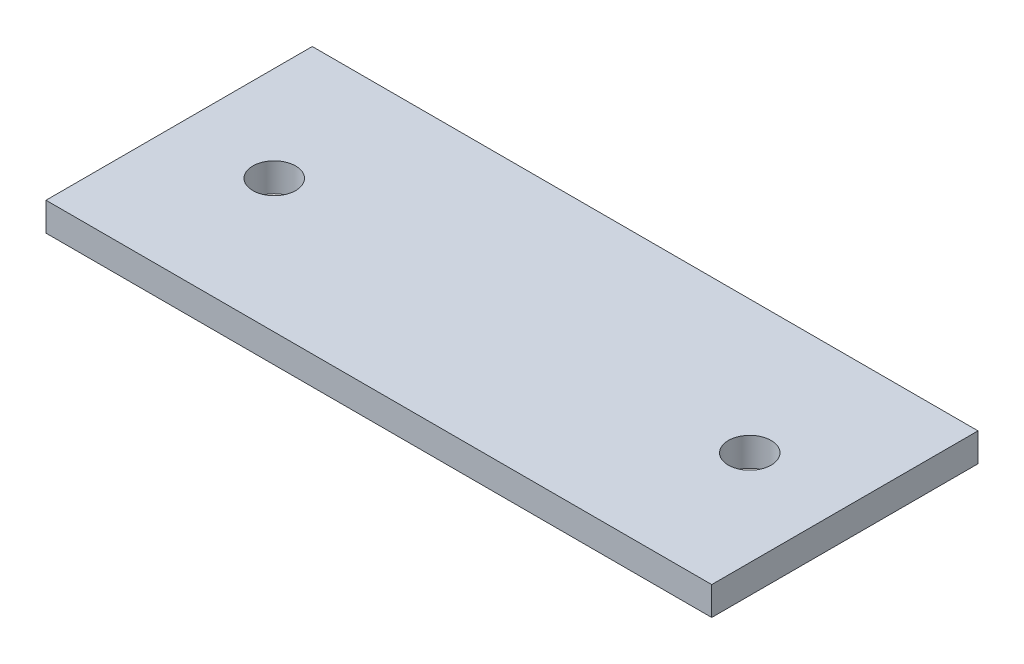
ISO-10303-21;
HEADER;
FILE_DESCRIPTION(('STEP AP214'),'2;1');
FILE_NAME('part.step','',(''),(''),'','','');
FILE_SCHEMA(('AUTOMOTIVE_DESIGN { 1 0 10303 214 1 1 1 1 }'));
ENDSEC;
DATA;
#1=APPLICATION_CONTEXT('core data for automotive mechanical design processes');
#2=APPLICATION_PROTOCOL_DEFINITION('international standard','automotive_design',2000,#1);
#3=PRODUCT_CONTEXT('',#1,'mechanical');
#4=PRODUCT('Part','Part','',(#3));
#5=PRODUCT_RELATED_PRODUCT_CATEGORY('part','',(#4));
#6=PRODUCT_DEFINITION_FORMATION('','',#4);
#7=PRODUCT_DEFINITION_CONTEXT('part definition',#1,'design');
#8=PRODUCT_DEFINITION('design','',#6,#7);
#9=PRODUCT_DEFINITION_SHAPE('','',#8);
#10=(LENGTH_UNIT() NAMED_UNIT(*) SI_UNIT(.MILLI.,.METRE.));
#11=(NAMED_UNIT(*) PLANE_ANGLE_UNIT() SI_UNIT($,.RADIAN.));
#12=(NAMED_UNIT(*) SI_UNIT($,.STERADIAN.) SOLID_ANGLE_UNIT());
#13=UNCERTAINTY_MEASURE_WITH_UNIT(LENGTH_MEASURE(1.E-05),#10,'distance_accuracy_value','');
#14=(GEOMETRIC_REPRESENTATION_CONTEXT(3) GLOBAL_UNCERTAINTY_ASSIGNED_CONTEXT((#13)) GLOBAL_UNIT_ASSIGNED_CONTEXT((#10,
#11,#12)) REPRESENTATION_CONTEXT('',''));
#15=CARTESIAN_POINT('',(0.,0.,0.));
#16=DIRECTION('',(0.,0.,1.));
#17=DIRECTION('',(1.,0.,0.));
#18=AXIS2_PLACEMENT_3D('',#15,#16,#17);
#19=CARTESIAN_POINT('',(0.,3.,0.));
#20=DIRECTION('',(0.,-1.,0.));
#21=DIRECTION('',(0.,0.,-1.));
#22=AXIS2_PLACEMENT_3D('',#19,#20,#21);
#23=PLANE('',#22);
#24=DIRECTION('',(0.,0.,1.));
#25=VECTOR('',#24,1.);
#26=CARTESIAN_POINT('',(0.,3.,0.));
#27=LINE('',#26,#25);
#28=CARTESIAN_POINT('',(0.,3.,-28.));
#29=VERTEX_POINT('',#28);
#30=CARTESIAN_POINT('',(0.,3.,0.));
#31=VERTEX_POINT('',#30);
#32=EDGE_CURVE('E85',#29,#31,#27,.T.);
#33=ORIENTED_EDGE('',*,*,#32,.T.);
#34=DIRECTION('',(1.,0.,0.));
#35=VECTOR('',#34,1.);
#36=CARTESIAN_POINT('',(0.,3.,0.));
#37=LINE('',#36,#35);
#38=CARTESIAN_POINT('',(70.,3.,0.));
#39=VERTEX_POINT('',#38);
#40=EDGE_CURVE('E80',#31,#39,#37,.T.);
#41=ORIENTED_EDGE('',*,*,#40,.T.);
#42=DIRECTION('',(0.,0.,-1.));
#43=VECTOR('',#42,1.);
#44=CARTESIAN_POINT('',(70.,3.,0.));
#45=LINE('',#44,#43);
#46=CARTESIAN_POINT('',(70.,3.,-28.));
#47=VERTEX_POINT('',#46);
#48=EDGE_CURVE('E83',#39,#47,#45,.T.);
#49=ORIENTED_EDGE('',*,*,#48,.T.);
#50=DIRECTION('',(-1.,0.,0.));
#51=VECTOR('',#50,1.);
#52=CARTESIAN_POINT('',(0.,3.,-28.));
#53=LINE('',#52,#51);
#54=EDGE_CURVE('E50',#47,#29,#53,.T.);
#55=ORIENTED_EDGE('',*,*,#54,.T.);
#56=EDGE_LOOP('',(#33,#41,#49,#55));
#57=FACE_BOUND('',#56,.T.);
#58=CARTESIAN_POINT('',(10.,3.,-14.));
#59=DIRECTION('',(0.,1.,0.));
#60=DIRECTION('',(0.,0.,1.));
#61=AXIS2_PLACEMENT_3D('',#58,#59,#60);
#62=CIRCLE('',#61,2.25);
#63=CARTESIAN_POINT('',(10.,3.,-11.75));
#64=VERTEX_POINT('',#63);
#65=EDGE_CURVE('E100',#64,#64,#62,.T.);
#66=ORIENTED_EDGE('',*,*,#65,.F.);
#67=EDGE_LOOP('',(#66));
#68=FACE_BOUND('',#67,.T.);
#69=CARTESIAN_POINT('',(60.,3.,-14.));
#70=DIRECTION('',(0.,1.,0.));
#71=DIRECTION('',(0.,0.,1.));
#72=AXIS2_PLACEMENT_3D('',#69,#70,#71);
#73=CIRCLE('',#72,2.25);
#74=CARTESIAN_POINT('',(60.,3.,-11.75));
#75=VERTEX_POINT('',#74);
#76=EDGE_CURVE('E115',#75,#75,#73,.T.);
#77=ORIENTED_EDGE('',*,*,#76,.F.);
#78=EDGE_LOOP('',(#77));
#79=FACE_BOUND('',#78,.T.);
#80=ADVANCED_FACE('F33',(#57,#68,#79),#23,.F.);
#81=CARTESIAN_POINT('',(0.,0.,0.));
#82=DIRECTION('',(0.,-1.,0.));
#83=DIRECTION('',(0.,0.,-1.));
#84=AXIS2_PLACEMENT_3D('',#81,#82,#83);
#85=PLANE('',#84);
#86=CARTESIAN_POINT('',(10.,0.,-14.));
#87=DIRECTION('',(0.,1.,0.));
#88=DIRECTION('',(0.,0.,1.));
#89=AXIS2_PLACEMENT_3D('',#86,#87,#88);
#90=CIRCLE('',#89,2.25);
#91=CARTESIAN_POINT('',(10.,0.,-11.75));
#92=VERTEX_POINT('',#91);
#93=EDGE_CURVE('E112',#92,#92,#90,.T.);
#94=ORIENTED_EDGE('',*,*,#93,.T.);
#95=EDGE_LOOP('',(#94));
#96=FACE_BOUND('',#95,.T.);
#97=DIRECTION('',(0.,0.,1.));
#98=VECTOR('',#97,1.);
#99=CARTESIAN_POINT('',(0.,0.,0.));
#100=LINE('',#99,#98);
#101=CARTESIAN_POINT('',(0.,0.,-28.));
#102=VERTEX_POINT('',#101);
#103=CARTESIAN_POINT('',(0.,0.,0.));
#104=VERTEX_POINT('',#103);
#105=EDGE_CURVE('E97',#102,#104,#100,.T.);
#106=ORIENTED_EDGE('',*,*,#105,.F.);
#107=DIRECTION('',(-1.,0.,0.));
#108=VECTOR('',#107,1.);
#109=CARTESIAN_POINT('',(0.,0.,-28.));
#110=LINE('',#109,#108);
#111=CARTESIAN_POINT('',(70.,0.,-28.));
#112=VERTEX_POINT('',#111);
#113=EDGE_CURVE('E73',#112,#102,#110,.T.);
#114=ORIENTED_EDGE('',*,*,#113,.F.);
#115=DIRECTION('',(0.,0.,-1.));
#116=VECTOR('',#115,1.);
#117=CARTESIAN_POINT('',(70.,0.,0.));
#118=LINE('',#117,#116);
#119=CARTESIAN_POINT('',(70.,0.,0.));
#120=VERTEX_POINT('',#119);
#121=EDGE_CURVE('E67',#120,#112,#118,.T.);
#122=ORIENTED_EDGE('',*,*,#121,.F.);
#123=DIRECTION('',(1.,0.,0.));
#124=VECTOR('',#123,1.);
#125=CARTESIAN_POINT('',(0.,0.,0.));
#126=LINE('',#125,#124);
#127=EDGE_CURVE('E89',#104,#120,#126,.T.);
#128=ORIENTED_EDGE('',*,*,#127,.F.);
#129=EDGE_LOOP('',(#106,#114,#122,#128));
#130=FACE_BOUND('',#129,.T.);
#131=CARTESIAN_POINT('',(60.,0.,-14.));
#132=DIRECTION('',(0.,1.,0.));
#133=DIRECTION('',(0.,0.,1.));
#134=AXIS2_PLACEMENT_3D('',#131,#132,#133);
#135=CIRCLE('',#134,2.25);
#136=CARTESIAN_POINT('',(60.,0.,-11.75));
#137=VERTEX_POINT('',#136);
#138=EDGE_CURVE('E118',#137,#137,#135,.T.);
#139=ORIENTED_EDGE('',*,*,#138,.T.);
#140=EDGE_LOOP('',(#139));
#141=FACE_BOUND('',#140,.T.);
#142=ADVANCED_FACE('F108',(#96,#130,#141),#85,.T.);
#143=CARTESIAN_POINT('',(0.,3.,0.));
#144=DIRECTION('',(1.,0.,0.));
#145=DIRECTION('',(0.,0.,-1.));
#146=AXIS2_PLACEMENT_3D('',#143,#144,#145);
#147=PLANE('',#146);
#148=ORIENTED_EDGE('',*,*,#105,.T.);
#149=DIRECTION('',(0.,-1.,0.));
#150=VECTOR('',#149,1.);
#151=CARTESIAN_POINT('',(0.,3.,0.));
#152=LINE('',#151,#150);
#153=EDGE_CURVE('E11',#31,#104,#152,.T.);
#154=ORIENTED_EDGE('',*,*,#153,.F.);
#155=ORIENTED_EDGE('',*,*,#32,.F.);
#156=DIRECTION('',(0.,-1.,0.));
#157=VECTOR('',#156,1.);
#158=CARTESIAN_POINT('',(0.,3.,-28.));
#159=LINE('',#158,#157);
#160=EDGE_CURVE('E93',#29,#102,#159,.T.);
#161=ORIENTED_EDGE('',*,*,#160,.T.);
#162=EDGE_LOOP('',(#148,#154,#155,#161));
#163=FACE_BOUND('',#162,.T.);
#164=ADVANCED_FACE('F35',(#163),#147,.F.);
#165=CARTESIAN_POINT('',(0.,3.,0.));
#166=DIRECTION('',(0.,0.,-1.));
#167=DIRECTION('',(-1.,0.,0.));
#168=AXIS2_PLACEMENT_3D('',#165,#166,#167);
#169=PLANE('',#168);
#170=ORIENTED_EDGE('',*,*,#127,.T.);
#171=DIRECTION('',(0.,-1.,0.));
#172=VECTOR('',#171,1.);
#173=CARTESIAN_POINT('',(70.,3.,0.));
#174=LINE('',#173,#172);
#175=EDGE_CURVE('E42',#39,#120,#174,.T.);
#176=ORIENTED_EDGE('',*,*,#175,.F.);
#177=ORIENTED_EDGE('',*,*,#40,.F.);
#178=ORIENTED_EDGE('',*,*,#153,.T.);
#179=EDGE_LOOP('',(#170,#176,#177,#178));
#180=FACE_BOUND('',#179,.T.);
#181=ADVANCED_FACE('F88',(#180),#169,.F.);
#182=CARTESIAN_POINT('',(70.,3.,0.));
#183=DIRECTION('',(-1.,0.,0.));
#184=DIRECTION('',(0.,0.,1.));
#185=AXIS2_PLACEMENT_3D('',#182,#183,#184);
#186=PLANE('',#185);
#187=ORIENTED_EDGE('',*,*,#121,.T.);
#188=DIRECTION('',(0.,-1.,0.));
#189=VECTOR('',#188,1.);
#190=CARTESIAN_POINT('',(70.,3.,-28.));
#191=LINE('',#190,#189);
#192=EDGE_CURVE('E90',#47,#112,#191,.T.);
#193=ORIENTED_EDGE('',*,*,#192,.F.);
#194=ORIENTED_EDGE('',*,*,#48,.F.);
#195=ORIENTED_EDGE('',*,*,#175,.T.);
#196=EDGE_LOOP('',(#187,#193,#194,#195));
#197=FACE_BOUND('',#196,.T.);
#198=ADVANCED_FACE('F91',(#197),#186,.F.);
#199=CARTESIAN_POINT('',(0.,3.,-28.));
#200=DIRECTION('',(0.,0.,1.));
#201=DIRECTION('',(1.,0.,0.));
#202=AXIS2_PLACEMENT_3D('',#199,#200,#201);
#203=PLANE('',#202);
#204=ORIENTED_EDGE('',*,*,#113,.T.);
#205=ORIENTED_EDGE('',*,*,#160,.F.);
#206=ORIENTED_EDGE('',*,*,#54,.F.);
#207=ORIENTED_EDGE('',*,*,#192,.T.);
#208=EDGE_LOOP('',(#204,#205,#206,#207));
#209=FACE_BOUND('',#208,.T.);
#210=ADVANCED_FACE('F105',(#209),#203,.F.);
#211=CARTESIAN_POINT('',(10.,3.,-14.));
#212=DIRECTION('',(0.,-1.,0.));
#213=DIRECTION('',(0.,0.,-1.));
#214=AXIS2_PLACEMENT_3D('',#211,#212,#213);
#215=CYLINDRICAL_SURFACE('',#214,2.25);
#216=ORIENTED_EDGE('',*,*,#65,.T.);
#217=EDGE_LOOP('',(#216));
#218=FACE_BOUND('',#217,.T.);
#219=ORIENTED_EDGE('',*,*,#93,.F.);
#220=EDGE_LOOP('',(#219));
#221=FACE_BOUND('',#220,.T.);
#222=ADVANCED_FACE('F135',(#218,#221),#215,.F.);
#223=CARTESIAN_POINT('',(60.,3.,-14.));
#224=DIRECTION('',(0.,-1.,0.));
#225=DIRECTION('',(0.,0.,-1.));
#226=AXIS2_PLACEMENT_3D('',#223,#224,#225);
#227=CYLINDRICAL_SURFACE('',#226,2.25);
#228=ORIENTED_EDGE('',*,*,#76,.T.);
#229=EDGE_LOOP('',(#228));
#230=FACE_BOUND('',#229,.T.);
#231=ORIENTED_EDGE('',*,*,#138,.F.);
#232=EDGE_LOOP('',(#231));
#233=FACE_BOUND('',#232,.T.);
#234=ADVANCED_FACE('F124',(#230,#233),#227,.F.);
#235=CLOSED_SHELL('',(#80,#142,#164,#181,#198,#210,#222,#234));
#236=MANIFOLD_SOLID_BREP('B2',#235);
#237=ADVANCED_BREP_SHAPE_REPRESENTATION('',(#18,#236),#14);
#238=SHAPE_DEFINITION_REPRESENTATION(#9,#237);
ENDSEC;
END-ISO-10303-21;
